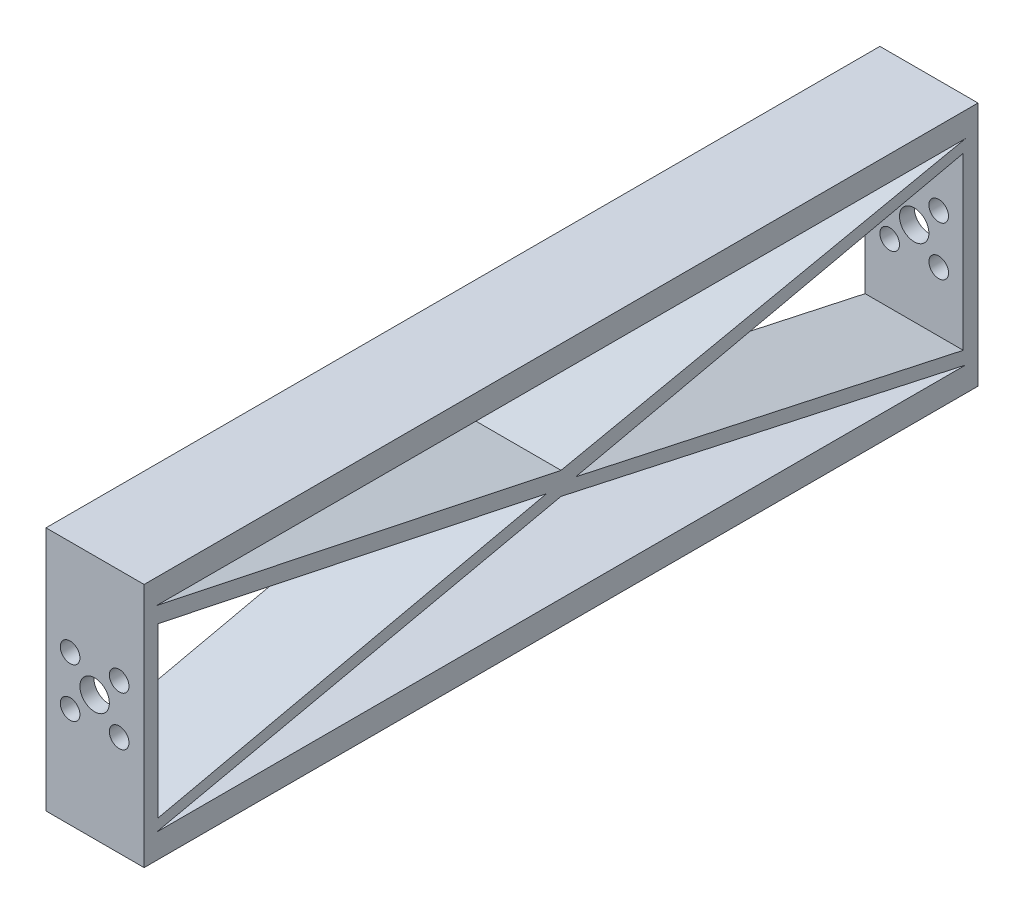
ISO-10303-21;
HEADER;
FILE_DESCRIPTION(('STEP AP214'),'2;1');
FILE_NAME('part.step','',(''),(''),'','','');
FILE_SCHEMA(('AUTOMOTIVE_DESIGN { 1 0 10303 214 1 1 1 1 }'));
ENDSEC;
DATA;
#1=APPLICATION_CONTEXT('core data for automotive mechanical design processes');
#2=APPLICATION_PROTOCOL_DEFINITION('international standard','automotive_design',2000,#1);
#3=PRODUCT_CONTEXT('',#1,'mechanical');
#4=PRODUCT('Part','Part','',(#3));
#5=PRODUCT_RELATED_PRODUCT_CATEGORY('part','',(#4));
#6=PRODUCT_DEFINITION_FORMATION('','',#4);
#7=PRODUCT_DEFINITION_CONTEXT('part definition',#1,'design');
#8=PRODUCT_DEFINITION('design','',#6,#7);
#9=PRODUCT_DEFINITION_SHAPE('','',#8);
#10=(LENGTH_UNIT() NAMED_UNIT(*) SI_UNIT(.MILLI.,.METRE.));
#11=(NAMED_UNIT(*) PLANE_ANGLE_UNIT() SI_UNIT($,.RADIAN.));
#12=(NAMED_UNIT(*) SI_UNIT($,.STERADIAN.) SOLID_ANGLE_UNIT());
#13=UNCERTAINTY_MEASURE_WITH_UNIT(LENGTH_MEASURE(1.E-05),#10,'distance_accuracy_value','');
#14=(GEOMETRIC_REPRESENTATION_CONTEXT(3) GLOBAL_UNCERTAINTY_ASSIGNED_CONTEXT((#13)) GLOBAL_UNIT_ASSIGNED_CONTEXT((#10,
#11,#12)) REPRESENTATION_CONTEXT('',''));
#15=CARTESIAN_POINT('',(0.,0.,0.));
#16=DIRECTION('',(0.,0.,1.));
#17=DIRECTION('',(1.,0.,0.));
#18=AXIS2_PLACEMENT_3D('',#15,#16,#17);
#19=CARTESIAN_POINT('',(20.,0.,0.));
#20=DIRECTION('',(1.,0.,0.));
#21=DIRECTION('',(0.,0.,-1.));
#22=AXIS2_PLACEMENT_3D('',#19,#20,#21);
#23=PLANE('',#22);
#24=DIRECTION('',(0.,-0.217683623773377,0.976019385023111));
#25=VECTOR('',#24,1.);
#26=CARTESIAN_POINT('',(20.,0.,2.99411560938043));
#27=LINE('',#26,#25);
#28=CARTESIAN_POINT('',(20.,0.,2.99411560938043));
#29=VERTEX_POINT('',#28);
#30=CARTESIAN_POINT('',(20.,-17.6539857058807,82.1485874671195));
#31=VERTEX_POINT('',#30);
#32=EDGE_CURVE('E153',#29,#31,#27,.T.);
#33=ORIENTED_EDGE('',*,*,#32,.T.);
#34=DIRECTION('',(0.,1.,0.));
#35=VECTOR('',#34,1.);
#36=CARTESIAN_POINT('',(20.,16.6477294414774,82.1485874671195));
#37=LINE('',#36,#35);
#38=CARTESIAN_POINT('',(20.,16.6477294414774,82.1485874671195));
#39=VERTEX_POINT('',#38);
#40=EDGE_CURVE('E160',#31,#39,#37,.T.);
#41=ORIENTED_EDGE('',*,*,#40,.T.);
#42=DIRECTION('',(0.,-0.205816684330834,-0.978590564256095));
#43=VECTOR('',#42,1.);
#44=CARTESIAN_POINT('',(20.,0.,2.99411560938043));
#45=LINE('',#44,#43);
#46=EDGE_CURVE('E53',#39,#29,#45,.T.);
#47=ORIENTED_EDGE('',*,*,#46,.T.);
#48=EDGE_LOOP('',(#33,#41,#47));
#49=FACE_BOUND('',#48,.T.);
#50=DIRECTION('',(0.,0.21225221971698,0.977214917623147));
#51=VECTOR('',#50,1.);
#52=CARTESIAN_POINT('',(20.,0.,-2.99411560938062));
#53=LINE('',#52,#51);
#54=CARTESIAN_POINT('',(20.,-17.1585856076037,-81.992704379959));
#55=VERTEX_POINT('',#54);
#56=CARTESIAN_POINT('',(20.,0.,-2.99411560938062));
#57=VERTEX_POINT('',#56);
#58=EDGE_CURVE('E182',#55,#57,#53,.T.);
#59=ORIENTED_EDGE('',*,*,#58,.T.);
#60=DIRECTION('',(0.,0.217683623773377,-0.976019385023111));
#61=VECTOR('',#60,1.);
#62=CARTESIAN_POINT('',(20.,0.,-2.99411560938062));
#63=LINE('',#62,#61);
#64=CARTESIAN_POINT('',(20.,17.6192187782778,-81.992704379959));
#65=VERTEX_POINT('',#64);
#66=EDGE_CURVE('E185',#57,#65,#63,.T.);
#67=ORIENTED_EDGE('',*,*,#66,.T.);
#68=DIRECTION('',(0.,-1.,0.));
#69=VECTOR('',#68,1.);
#70=CARTESIAN_POINT('',(20.,17.6192187782778,-81.992704379959));
#71=LINE('',#70,#69);
#72=EDGE_CURVE('E189',#65,#55,#71,.T.);
#73=ORIENTED_EDGE('',*,*,#72,.T.);
#74=EDGE_LOOP('',(#59,#67,#73));
#75=FACE_BOUND('',#74,.T.);
#76=DIRECTION('',(0.,0.205816684330834,0.978590564256095));
#77=VECTOR('',#76,1.);
#78=CARTESIAN_POINT('',(20.,2.53644296567931,-0.533463432265187));
#79=LINE('',#78,#77);
#80=CARTESIAN_POINT('',(20.,2.64864073137515,0.));
#81=VERTEX_POINT('',#80);
#82=CARTESIAN_POINT('',(20.,20.,82.5));
#83=VERTEX_POINT('',#82);
#84=EDGE_CURVE('E235',#81,#83,#79,.T.);
#85=ORIENTED_EDGE('',*,*,#84,.T.);
#86=DIRECTION('',(0.,0.,1.));
#87=VECTOR('',#86,1.);
#88=CARTESIAN_POINT('',(20.,20.,0.));
#89=LINE('',#88,#87);
#90=CARTESIAN_POINT('',(20.,20.,-82.5));
#91=VERTEX_POINT('',#90);
#92=EDGE_CURVE('E229',#91,#83,#89,.T.);
#93=ORIENTED_EDGE('',*,*,#92,.F.);
#94=DIRECTION('',(0.,-0.205816684330834,0.978590564256095));
#95=VECTOR('',#94,1.);
#96=CARTESIAN_POINT('',(20.,2.53644296567931,0.533463432265187));
#97=LINE('',#96,#95);
#98=EDGE_CURVE('E231',#91,#81,#97,.T.);
#99=ORIENTED_EDGE('',*,*,#98,.T.);
#100=EDGE_LOOP('',(#85,#93,#99));
#101=FACE_BOUND('',#100,.T.);
#102=DIRECTION('',(0.,1.,0.));
#103=VECTOR('',#102,1.);
#104=CARTESIAN_POINT('',(20.,25.,-85.0000000000001));
#105=LINE('',#104,#103);
#106=CARTESIAN_POINT('',(20.,-25.,-85.0000000000001));
#107=VERTEX_POINT('',#106);
#108=CARTESIAN_POINT('',(20.,25.,-85.0000000000001));
#109=VERTEX_POINT('',#108);
#110=EDGE_CURVE('E253',#107,#109,#105,.T.);
#111=ORIENTED_EDGE('',*,*,#110,.T.);
#112=DIRECTION('',(0.,0.,1.));
#113=VECTOR('',#112,1.);
#114=CARTESIAN_POINT('',(20.,25.,84.9999999999999));
#115=LINE('',#114,#113);
#116=CARTESIAN_POINT('',(20.,25.,84.9999999999999));
#117=VERTEX_POINT('',#116);
#118=EDGE_CURVE('E256',#109,#117,#115,.T.);
#119=ORIENTED_EDGE('',*,*,#118,.T.);
#120=DIRECTION('',(0.,-1.,0.));
#121=VECTOR('',#120,1.);
#122=CARTESIAN_POINT('',(20.,25.,84.9999999999999));
#123=LINE('',#122,#121);
#124=CARTESIAN_POINT('',(20.,-25.,84.9999999999999));
#125=VERTEX_POINT('',#124);
#126=EDGE_CURVE('E259',#117,#125,#123,.T.);
#127=ORIENTED_EDGE('',*,*,#126,.T.);
#128=DIRECTION('',(0.,0.,-1.));
#129=VECTOR('',#128,1.);
#130=CARTESIAN_POINT('',(20.,-25.,84.9999999999999));
#131=LINE('',#130,#129);
#132=EDGE_CURVE('E261',#125,#107,#131,.T.);
#133=ORIENTED_EDGE('',*,*,#132,.T.);
#134=EDGE_LOOP('',(#111,#119,#127,#133));
#135=FACE_BOUND('',#134,.T.);
#136=DIRECTION('',(0.,0.,1.));
#137=VECTOR('',#136,1.);
#138=CARTESIAN_POINT('',(20.,-20.,0.));
#139=LINE('',#138,#137);
#140=CARTESIAN_POINT('',(20.,-20.,-82.5));
#141=VERTEX_POINT('',#140);
#142=CARTESIAN_POINT('',(20.,-20.,82.5));
#143=VERTEX_POINT('',#142);
#144=EDGE_CURVE('E211',#141,#143,#139,.T.);
#145=ORIENTED_EDGE('',*,*,#144,.T.);
#146=DIRECTION('',(0.,-0.213645280255902,0.976911303151099));
#147=VECTOR('',#146,1.);
#148=CARTESIAN_POINT('',(20.,-1.86833352987041,-0.408594556448615));
#149=LINE('',#148,#147);
#150=CARTESIAN_POINT('',(20.,-1.9576909753641,0.));
#151=VERTEX_POINT('',#150);
#152=EDGE_CURVE('E206',#151,#143,#149,.T.);
#153=ORIENTED_EDGE('',*,*,#152,.F.);
#154=DIRECTION('',(0.,0.213645280255902,0.976911303151099));
#155=VECTOR('',#154,1.);
#156=CARTESIAN_POINT('',(20.,-1.86833352987041,0.408594556448614));
#157=LINE('',#156,#155);
#158=EDGE_CURVE('E208',#141,#151,#157,.T.);
#159=ORIENTED_EDGE('',*,*,#158,.F.);
#160=EDGE_LOOP('',(#145,#153,#159));
#161=FACE_BOUND('',#160,.T.);
#162=ADVANCED_FACE('F36',(#49,#75,#101,#135,#161),#23,.T.);
#163=CARTESIAN_POINT('',(0.,0.,0.));
#164=DIRECTION('',(1.,0.,0.));
#165=DIRECTION('',(0.,0.,-1.));
#166=AXIS2_PLACEMENT_3D('',#163,#164,#165);
#167=PLANE('',#166);
#168=DIRECTION('',(0.,1.,0.));
#169=VECTOR('',#168,1.);
#170=CARTESIAN_POINT('',(0.,16.6477294414774,82.1485874671195));
#171=LINE('',#170,#169);
#172=CARTESIAN_POINT('',(0.,-17.6539857058807,82.1485874671195));
#173=VERTEX_POINT('',#172);
#174=CARTESIAN_POINT('',(0.,16.6477294414774,82.1485874671195));
#175=VERTEX_POINT('',#174);
#176=EDGE_CURVE('E168',#173,#175,#171,.T.);
#177=ORIENTED_EDGE('',*,*,#176,.F.);
#178=DIRECTION('',(0.,-0.217683623773377,0.976019385023111));
#179=VECTOR('',#178,1.);
#180=CARTESIAN_POINT('',(0.,0.,2.99411560938043));
#181=LINE('',#180,#179);
#182=CARTESIAN_POINT('',(0.,0.,2.99411560938043));
#183=VERTEX_POINT('',#182);
#184=EDGE_CURVE('E61',#183,#173,#181,.T.);
#185=ORIENTED_EDGE('',*,*,#184,.F.);
#186=DIRECTION('',(0.,-0.205816684330834,-0.978590564256095));
#187=VECTOR('',#186,1.);
#188=CARTESIAN_POINT('',(0.,0.,2.99411560938043));
#189=LINE('',#188,#187);
#190=EDGE_CURVE('E165',#175,#183,#189,.T.);
#191=ORIENTED_EDGE('',*,*,#190,.F.);
#192=EDGE_LOOP('',(#177,#185,#191));
#193=FACE_BOUND('',#192,.T.);
#194=DIRECTION('',(0.,0.217683623773377,-0.976019385023111));
#195=VECTOR('',#194,1.);
#196=CARTESIAN_POINT('',(0.,0.,-2.99411560938062));
#197=LINE('',#196,#195);
#198=CARTESIAN_POINT('',(0.,0.,-2.99411560938062));
#199=VERTEX_POINT('',#198);
#200=CARTESIAN_POINT('',(0.,17.6192187782778,-81.992704379959));
#201=VERTEX_POINT('',#200);
#202=EDGE_CURVE('E194',#199,#201,#197,.T.);
#203=ORIENTED_EDGE('',*,*,#202,.F.);
#204=DIRECTION('',(0.,0.21225221971698,0.977214917623147));
#205=VECTOR('',#204,1.);
#206=CARTESIAN_POINT('',(0.,0.,-2.99411560938062));
#207=LINE('',#206,#205);
#208=CARTESIAN_POINT('',(0.,-17.1585856076037,-81.992704379959));
#209=VERTEX_POINT('',#208);
#210=EDGE_CURVE('E180',#209,#199,#207,.T.);
#211=ORIENTED_EDGE('',*,*,#210,.F.);
#212=DIRECTION('',(0.,-1.,0.));
#213=VECTOR('',#212,1.);
#214=CARTESIAN_POINT('',(0.,17.6192187782778,-81.992704379959));
#215=LINE('',#214,#213);
#216=EDGE_CURVE('E186',#201,#209,#215,.T.);
#217=ORIENTED_EDGE('',*,*,#216,.F.);
#218=EDGE_LOOP('',(#203,#211,#217));
#219=FACE_BOUND('',#218,.T.);
#220=DIRECTION('',(0.,0.,1.));
#221=VECTOR('',#220,1.);
#222=CARTESIAN_POINT('',(0.,20.,0.));
#223=LINE('',#222,#221);
#224=CARTESIAN_POINT('',(0.,20.,-82.5));
#225=VERTEX_POINT('',#224);
#226=CARTESIAN_POINT('',(0.,20.,82.5));
#227=VERTEX_POINT('',#226);
#228=EDGE_CURVE('E224',#225,#227,#223,.T.);
#229=ORIENTED_EDGE('',*,*,#228,.T.);
#230=DIRECTION('',(0.,0.205816684330834,0.978590564256095));
#231=VECTOR('',#230,1.);
#232=CARTESIAN_POINT('',(0.,2.53644296567931,-0.533463432265187));
#233=LINE('',#232,#231);
#234=CARTESIAN_POINT('',(0.,2.64864073137515,0.));
#235=VERTEX_POINT('',#234);
#236=EDGE_CURVE('E232',#235,#227,#233,.T.);
#237=ORIENTED_EDGE('',*,*,#236,.F.);
#238=DIRECTION('',(0.,-0.205816684330834,0.978590564256095));
#239=VECTOR('',#238,1.);
#240=CARTESIAN_POINT('',(0.,2.53644296567931,0.533463432265187));
#241=LINE('',#240,#239);
#242=EDGE_CURVE('E241',#225,#235,#241,.T.);
#243=ORIENTED_EDGE('',*,*,#242,.F.);
#244=EDGE_LOOP('',(#229,#237,#243));
#245=FACE_BOUND('',#244,.T.);
#246=DIRECTION('',(0.,1.,0.));
#247=VECTOR('',#246,1.);
#248=CARTESIAN_POINT('',(0.,25.,-85.0000000000001));
#249=LINE('',#248,#247);
#250=CARTESIAN_POINT('',(0.,-25.,-85.0000000000001));
#251=VERTEX_POINT('',#250);
#252=CARTESIAN_POINT('',(0.,25.,-85.0000000000001));
#253=VERTEX_POINT('',#252);
#254=EDGE_CURVE('E248',#251,#253,#249,.T.);
#255=ORIENTED_EDGE('',*,*,#254,.F.);
#256=DIRECTION('',(0.,0.,-1.));
#257=VECTOR('',#256,1.);
#258=CARTESIAN_POINT('',(0.,-25.,84.9999999999999));
#259=LINE('',#258,#257);
#260=CARTESIAN_POINT('',(0.,-25.,84.9999999999999));
#261=VERTEX_POINT('',#260);
#262=EDGE_CURVE('E257',#261,#251,#259,.T.);
#263=ORIENTED_EDGE('',*,*,#262,.F.);
#264=DIRECTION('',(0.,-1.,0.));
#265=VECTOR('',#264,1.);
#266=CARTESIAN_POINT('',(0.,25.,84.9999999999999));
#267=LINE('',#266,#265);
#268=CARTESIAN_POINT('',(0.,25.,84.9999999999999));
#269=VERTEX_POINT('',#268);
#270=EDGE_CURVE('E268',#269,#261,#267,.T.);
#271=ORIENTED_EDGE('',*,*,#270,.F.);
#272=DIRECTION('',(0.,0.,1.));
#273=VECTOR('',#272,1.);
#274=CARTESIAN_POINT('',(0.,25.,84.9999999999999));
#275=LINE('',#274,#273);
#276=EDGE_CURVE('E266',#253,#269,#275,.T.);
#277=ORIENTED_EDGE('',*,*,#276,.F.);
#278=EDGE_LOOP('',(#255,#263,#271,#277));
#279=FACE_BOUND('',#278,.T.);
#280=DIRECTION('',(0.,-0.213645280255902,0.976911303151099));
#281=VECTOR('',#280,1.);
#282=CARTESIAN_POINT('',(0.,-1.86833352987041,-0.408594556448615));
#283=LINE('',#282,#281);
#284=CARTESIAN_POINT('',(0.,-1.9576909753641,0.));
#285=VERTEX_POINT('',#284);
#286=CARTESIAN_POINT('',(0.,-20.,82.5));
#287=VERTEX_POINT('',#286);
#288=EDGE_CURVE('E201',#285,#287,#283,.T.);
#289=ORIENTED_EDGE('',*,*,#288,.T.);
#290=DIRECTION('',(0.,0.,1.));
#291=VECTOR('',#290,1.);
#292=CARTESIAN_POINT('',(0.,-20.,0.));
#293=LINE('',#292,#291);
#294=CARTESIAN_POINT('',(0.,-20.,-82.5));
#295=VERTEX_POINT('',#294);
#296=EDGE_CURVE('E209',#295,#287,#293,.T.);
#297=ORIENTED_EDGE('',*,*,#296,.F.);
#298=DIRECTION('',(0.,0.213645280255902,0.976911303151099));
#299=VECTOR('',#298,1.);
#300=CARTESIAN_POINT('',(0.,-1.86833352987041,0.408594556448614));
#301=LINE('',#300,#299);
#302=EDGE_CURVE('E217',#295,#285,#301,.T.);
#303=ORIENTED_EDGE('',*,*,#302,.T.);
#304=EDGE_LOOP('',(#289,#297,#303));
#305=FACE_BOUND('',#304,.T.);
#306=ADVANCED_FACE('F357',(#193,#219,#245,#279,#305),#167,.F.);
#307=CARTESIAN_POINT('',(20.,25.,-85.0000000000001));
#308=DIRECTION('',(0.,0.,1.));
#309=DIRECTION('',(1.,0.,0.));
#310=AXIS2_PLACEMENT_3D('',#307,#308,#309);
#311=PLANE('',#310);
#312=CARTESIAN_POINT('',(15.,-5.,-85.0000000000001));
#313=DIRECTION('',(0.,0.,-1.));
#314=DIRECTION('',(-1.,0.,0.));
#315=AXIS2_PLACEMENT_3D('',#312,#313,#314);
#316=CIRCLE('',#315,2.);
#317=CARTESIAN_POINT('',(13.,-5.,-85.0000000000001));
#318=VERTEX_POINT('',#317);
#319=EDGE_CURVE('E319',#318,#318,#316,.T.);
#320=ORIENTED_EDGE('',*,*,#319,.F.);
#321=EDGE_LOOP('',(#320));
#322=FACE_BOUND('',#321,.T.);
#323=CARTESIAN_POINT('',(5.,-5.,-85.0000000000001));
#324=DIRECTION('',(0.,0.,-1.));
#325=DIRECTION('',(-1.,0.,0.));
#326=AXIS2_PLACEMENT_3D('',#323,#324,#325);
#327=CIRCLE('',#326,2.);
#328=CARTESIAN_POINT('',(3.,-5.,-85.0000000000001));
#329=VERTEX_POINT('',#328);
#330=EDGE_CURVE('E309',#329,#329,#327,.T.);
#331=ORIENTED_EDGE('',*,*,#330,.F.);
#332=EDGE_LOOP('',(#331));
#333=FACE_BOUND('',#332,.T.);
#334=CARTESIAN_POINT('',(10.,0.,-85.0000000000001));
#335=DIRECTION('',(0.,0.,-1.));
#336=DIRECTION('',(-1.,0.,0.));
#337=AXIS2_PLACEMENT_3D('',#334,#335,#336);
#338=CIRCLE('',#337,3.);
#339=CARTESIAN_POINT('',(7.,0.,-85.0000000000001));
#340=VERTEX_POINT('',#339);
#341=EDGE_CURVE('E306',#340,#340,#338,.T.);
#342=ORIENTED_EDGE('',*,*,#341,.F.);
#343=EDGE_LOOP('',(#342));
#344=FACE_BOUND('',#343,.T.);
#345=CARTESIAN_POINT('',(5.,5.,-85.0000000000001));
#346=DIRECTION('',(0.,0.,-1.));
#347=DIRECTION('',(-1.,0.,0.));
#348=AXIS2_PLACEMENT_3D('',#345,#346,#347);
#349=CIRCLE('',#348,2.);
#350=CARTESIAN_POINT('',(3.,5.,-85.0000000000001));
#351=VERTEX_POINT('',#350);
#352=EDGE_CURVE('E303',#351,#351,#349,.T.);
#353=ORIENTED_EDGE('',*,*,#352,.F.);
#354=EDGE_LOOP('',(#353));
#355=FACE_BOUND('',#354,.T.);
#356=CARTESIAN_POINT('',(15.,5.,-85.0000000000001));
#357=DIRECTION('',(0.,0.,-1.));
#358=DIRECTION('',(-1.,0.,0.));
#359=AXIS2_PLACEMENT_3D('',#356,#357,#358);
#360=CIRCLE('',#359,2.);
#361=CARTESIAN_POINT('',(13.,5.,-85.0000000000001));
#362=VERTEX_POINT('',#361);
#363=EDGE_CURVE('E299',#362,#362,#360,.T.);
#364=ORIENTED_EDGE('',*,*,#363,.F.);
#365=EDGE_LOOP('',(#364));
#366=FACE_BOUND('',#365,.T.);
#367=ORIENTED_EDGE('',*,*,#254,.T.);
#368=DIRECTION('',(-1.,0.,0.));
#369=VECTOR('',#368,1.);
#370=CARTESIAN_POINT('',(20.,25.,-85.0000000000001));
#371=LINE('',#370,#369);
#372=EDGE_CURVE('E11',#109,#253,#371,.T.);
#373=ORIENTED_EDGE('',*,*,#372,.F.);
#374=ORIENTED_EDGE('',*,*,#110,.F.);
#375=DIRECTION('',(-1.,0.,0.));
#376=VECTOR('',#375,1.);
#377=CARTESIAN_POINT('',(20.,-25.,-85.0000000000001));
#378=LINE('',#377,#376);
#379=EDGE_CURVE('E263',#107,#251,#378,.T.);
#380=ORIENTED_EDGE('',*,*,#379,.T.);
#381=EDGE_LOOP('',(#367,#373,#374,#380));
#382=FACE_BOUND('',#381,.T.);
#383=ADVANCED_FACE('F38',(#322,#333,#344,#355,#366,#382),#311,.F.);
#384=CARTESIAN_POINT('',(20.,25.,84.9999999999999));
#385=DIRECTION('',(0.,-1.,0.));
#386=DIRECTION('',(0.,0.,-1.));
#387=AXIS2_PLACEMENT_3D('',#384,#385,#386);
#388=PLANE('',#387);
#389=ORIENTED_EDGE('',*,*,#276,.T.);
#390=DIRECTION('',(-1.,0.,0.));
#391=VECTOR('',#390,1.);
#392=CARTESIAN_POINT('',(20.,25.,84.9999999999999));
#393=LINE('',#392,#391);
#394=EDGE_CURVE('E45',#117,#269,#393,.T.);
#395=ORIENTED_EDGE('',*,*,#394,.F.);
#396=ORIENTED_EDGE('',*,*,#118,.F.);
#397=ORIENTED_EDGE('',*,*,#372,.T.);
#398=EDGE_LOOP('',(#389,#395,#396,#397));
#399=FACE_BOUND('',#398,.T.);
#400=ADVANCED_FACE('F341',(#399),#388,.F.);
#401=CARTESIAN_POINT('',(20.,25.,84.9999999999999));
#402=DIRECTION('',(0.,0.,-1.));
#403=DIRECTION('',(-1.,0.,0.));
#404=AXIS2_PLACEMENT_3D('',#401,#402,#403);
#405=PLANE('',#404);
#406=CARTESIAN_POINT('',(4.91550237214592,5.47898451277321,84.9999999999999));
#407=DIRECTION('',(0.,0.,1.));
#408=DIRECTION('',(1.,0.,0.));
#409=AXIS2_PLACEMENT_3D('',#406,#407,#408);
#410=CIRCLE('',#409,2.);
#411=CARTESIAN_POINT('',(6.91550237214592,5.47898451277321,84.9999999999999));
#412=VERTEX_POINT('',#411);
#413=EDGE_CURVE('E295',#412,#412,#410,.T.);
#414=ORIENTED_EDGE('',*,*,#413,.F.);
#415=EDGE_LOOP('',(#414));
#416=FACE_BOUND('',#415,.T.);
#417=CARTESIAN_POINT('',(14.9155023721459,5.47898451277321,84.9999999999999));
#418=DIRECTION('',(0.,0.,1.));
#419=DIRECTION('',(1.,0.,0.));
#420=AXIS2_PLACEMENT_3D('',#417,#418,#419);
#421=CIRCLE('',#420,2.);
#422=CARTESIAN_POINT('',(16.9155023721459,5.47898451277321,84.9999999999999));
#423=VERTEX_POINT('',#422);
#424=EDGE_CURVE('E291',#423,#423,#421,.T.);
#425=ORIENTED_EDGE('',*,*,#424,.F.);
#426=EDGE_LOOP('',(#425));
#427=FACE_BOUND('',#426,.T.);
#428=CARTESIAN_POINT('',(9.91550237214592,0.478984512773212,84.9999999999999));
#429=DIRECTION('',(0.,0.,1.));
#430=DIRECTION('',(1.,0.,0.));
#431=AXIS2_PLACEMENT_3D('',#428,#429,#430);
#432=CIRCLE('',#431,3.);
#433=CARTESIAN_POINT('',(12.9155023721459,0.478984512773212,84.9999999999999));
#434=VERTEX_POINT('',#433);
#435=EDGE_CURVE('E287',#434,#434,#432,.T.);
#436=ORIENTED_EDGE('',*,*,#435,.F.);
#437=EDGE_LOOP('',(#436));
#438=FACE_BOUND('',#437,.T.);
#439=CARTESIAN_POINT('',(14.9155023721459,-4.52101548722679,84.9999999999999));
#440=DIRECTION('',(0.,0.,1.));
#441=DIRECTION('',(1.,0.,0.));
#442=AXIS2_PLACEMENT_3D('',#439,#440,#441);
#443=CIRCLE('',#442,2.);
#444=CARTESIAN_POINT('',(16.9155023721459,-4.52101548722679,84.9999999999999));
#445=VERTEX_POINT('',#444);
#446=EDGE_CURVE('E283',#445,#445,#443,.T.);
#447=ORIENTED_EDGE('',*,*,#446,.F.);
#448=EDGE_LOOP('',(#447));
#449=FACE_BOUND('',#448,.T.);
#450=CARTESIAN_POINT('',(4.91550237214592,-4.52101548722679,84.9999999999999));
#451=DIRECTION('',(0.,0.,1.));
#452=DIRECTION('',(1.,0.,0.));
#453=AXIS2_PLACEMENT_3D('',#450,#451,#452);
#454=CIRCLE('',#453,2.);
#455=CARTESIAN_POINT('',(6.91550237214592,-4.52101548722679,84.9999999999999));
#456=VERTEX_POINT('',#455);
#457=EDGE_CURVE('E171',#456,#456,#454,.T.);
#458=ORIENTED_EDGE('',*,*,#457,.F.);
#459=EDGE_LOOP('',(#458));
#460=FACE_BOUND('',#459,.T.);
#461=ORIENTED_EDGE('',*,*,#270,.T.);
#462=DIRECTION('',(-1.,0.,0.));
#463=VECTOR('',#462,1.);
#464=CARTESIAN_POINT('',(20.,-25.,84.9999999999999));
#465=LINE('',#464,#463);
#466=EDGE_CURVE('E273',#125,#261,#465,.T.);
#467=ORIENTED_EDGE('',*,*,#466,.F.);
#468=ORIENTED_EDGE('',*,*,#126,.F.);
#469=ORIENTED_EDGE('',*,*,#394,.T.);
#470=EDGE_LOOP('',(#461,#467,#468,#469));
#471=FACE_BOUND('',#470,.T.);
#472=ADVANCED_FACE('F337',(#416,#427,#438,#449,#460,#471),#405,.F.);
#473=CARTESIAN_POINT('',(20.,-25.,84.9999999999999));
#474=DIRECTION('',(0.,1.,0.));
#475=DIRECTION('',(0.,0.,1.));
#476=AXIS2_PLACEMENT_3D('',#473,#474,#475);
#477=PLANE('',#476);
#478=ORIENTED_EDGE('',*,*,#262,.T.);
#479=ORIENTED_EDGE('',*,*,#379,.F.);
#480=ORIENTED_EDGE('',*,*,#132,.F.);
#481=ORIENTED_EDGE('',*,*,#466,.T.);
#482=EDGE_LOOP('',(#478,#479,#480,#481));
#483=FACE_BOUND('',#482,.T.);
#484=ADVANCED_FACE('F340',(#483),#477,.F.);
#485=CARTESIAN_POINT('',(20.,20.,0.));
#486=DIRECTION('',(0.,-1.,0.));
#487=DIRECTION('',(0.,0.,-1.));
#488=AXIS2_PLACEMENT_3D('',#485,#486,#487);
#489=PLANE('',#488);
#490=ORIENTED_EDGE('',*,*,#228,.F.);
#491=DIRECTION('',(-1.,0.,0.));
#492=VECTOR('',#491,1.);
#493=CARTESIAN_POINT('',(20.,20.,-82.5));
#494=LINE('',#493,#492);
#495=EDGE_CURVE('E238',#91,#225,#494,.T.);
#496=ORIENTED_EDGE('',*,*,#495,.F.);
#497=ORIENTED_EDGE('',*,*,#92,.T.);
#498=DIRECTION('',(-1.,0.,0.));
#499=VECTOR('',#498,1.);
#500=CARTESIAN_POINT('',(20.,20.,82.5));
#501=LINE('',#500,#499);
#502=EDGE_CURVE('E246',#83,#227,#501,.T.);
#503=ORIENTED_EDGE('',*,*,#502,.T.);
#504=EDGE_LOOP('',(#490,#496,#497,#503));
#505=FACE_BOUND('',#504,.T.);
#506=ADVANCED_FACE('F378',(#505),#489,.T.);
#507=CARTESIAN_POINT('',(20.,2.53644296567931,-0.533463432265187));
#508=DIRECTION('',(0.,-0.978590564256095,0.205816684330834));
#509=DIRECTION('',(0.,-0.205816684330834,-0.978590564256095));
#510=AXIS2_PLACEMENT_3D('',#507,#508,#509);
#511=PLANE('',#510);
#512=ORIENTED_EDGE('',*,*,#236,.T.);
#513=ORIENTED_EDGE('',*,*,#502,.F.);
#514=ORIENTED_EDGE('',*,*,#84,.F.);
#515=DIRECTION('',(-1.,0.,0.));
#516=VECTOR('',#515,1.);
#517=CARTESIAN_POINT('',(20.,2.64864073137515,0.));
#518=LINE('',#517,#516);
#519=EDGE_CURVE('E249',#81,#235,#518,.T.);
#520=ORIENTED_EDGE('',*,*,#519,.T.);
#521=EDGE_LOOP('',(#512,#513,#514,#520));
#522=FACE_BOUND('',#521,.T.);
#523=ADVANCED_FACE('F385',(#522),#511,.F.);
#524=CARTESIAN_POINT('',(20.,2.53644296567931,0.533463432265187));
#525=DIRECTION('',(0.,-0.978590564256095,-0.205816684330834));
#526=DIRECTION('',(0.,0.205816684330834,-0.978590564256095));
#527=AXIS2_PLACEMENT_3D('',#524,#525,#526);
#528=PLANE('',#527);
#529=ORIENTED_EDGE('',*,*,#242,.T.);
#530=ORIENTED_EDGE('',*,*,#519,.F.);
#531=ORIENTED_EDGE('',*,*,#98,.F.);
#532=ORIENTED_EDGE('',*,*,#495,.T.);
#533=EDGE_LOOP('',(#529,#530,#531,#532));
#534=FACE_BOUND('',#533,.T.);
#535=ADVANCED_FACE('F390',(#534),#528,.F.);
#536=CARTESIAN_POINT('',(20.,-1.86833352987041,-0.408594556448615));
#537=DIRECTION('',(0.,-0.976911303151098,-0.213645280255902));
#538=DIRECTION('',(0.,0.213645280255902,-0.976911303151098));
#539=AXIS2_PLACEMENT_3D('',#536,#537,#538);
#540=PLANE('',#539);
#541=ORIENTED_EDGE('',*,*,#288,.F.);
#542=DIRECTION('',(-1.,0.,0.));
#543=VECTOR('',#542,1.);
#544=CARTESIAN_POINT('',(20.,-1.9576909753641,0.));
#545=LINE('',#544,#543);
#546=EDGE_CURVE('E214',#151,#285,#545,.T.);
#547=ORIENTED_EDGE('',*,*,#546,.F.);
#548=ORIENTED_EDGE('',*,*,#152,.T.);
#549=DIRECTION('',(-1.,0.,0.));
#550=VECTOR('',#549,1.);
#551=CARTESIAN_POINT('',(20.,-20.,82.5));
#552=LINE('',#551,#550);
#553=EDGE_CURVE('E222',#143,#287,#552,.T.);
#554=ORIENTED_EDGE('',*,*,#553,.T.);
#555=EDGE_LOOP('',(#541,#547,#548,#554));
#556=FACE_BOUND('',#555,.T.);
#557=ADVANCED_FACE('F403',(#556),#540,.T.);
#558=CARTESIAN_POINT('',(20.,-20.,0.));
#559=DIRECTION('',(0.,-1.,0.));
#560=DIRECTION('',(0.,0.,-1.));
#561=AXIS2_PLACEMENT_3D('',#558,#559,#560);
#562=PLANE('',#561);
#563=ORIENTED_EDGE('',*,*,#296,.T.);
#564=ORIENTED_EDGE('',*,*,#553,.F.);
#565=ORIENTED_EDGE('',*,*,#144,.F.);
#566=DIRECTION('',(-1.,0.,0.));
#567=VECTOR('',#566,1.);
#568=CARTESIAN_POINT('',(20.,-20.,-82.5));
#569=LINE('',#568,#567);
#570=EDGE_CURVE('E225',#141,#295,#569,.T.);
#571=ORIENTED_EDGE('',*,*,#570,.T.);
#572=EDGE_LOOP('',(#563,#564,#565,#571));
#573=FACE_BOUND('',#572,.T.);
#574=ADVANCED_FACE('F407',(#573),#562,.F.);
#575=CARTESIAN_POINT('',(20.,-1.86833352987041,0.408594556448614));
#576=DIRECTION('',(0.,-0.976911303151098,0.213645280255902));
#577=DIRECTION('',(0.,-0.213645280255902,-0.976911303151098));
#578=AXIS2_PLACEMENT_3D('',#575,#576,#577);
#579=PLANE('',#578);
#580=ORIENTED_EDGE('',*,*,#302,.F.);
#581=ORIENTED_EDGE('',*,*,#570,.F.);
#582=ORIENTED_EDGE('',*,*,#158,.T.);
#583=ORIENTED_EDGE('',*,*,#546,.T.);
#584=EDGE_LOOP('',(#580,#581,#582,#583));
#585=FACE_BOUND('',#584,.T.);
#586=ADVANCED_FACE('F411',(#585),#579,.T.);
#587=CARTESIAN_POINT('',(20.,0.,-2.99411560938062));
#588=DIRECTION('',(0.,-0.977214917623147,0.21225221971698));
#589=DIRECTION('',(0.,-0.21225221971698,-0.977214917623147));
#590=AXIS2_PLACEMENT_3D('',#587,#588,#589);
#591=PLANE('',#590);
#592=ORIENTED_EDGE('',*,*,#210,.T.);
#593=DIRECTION('',(-1.,0.,0.));
#594=VECTOR('',#593,1.);
#595=CARTESIAN_POINT('',(20.,0.,-2.99411560938062));
#596=LINE('',#595,#594);
#597=EDGE_CURVE('E192',#57,#199,#596,.T.);
#598=ORIENTED_EDGE('',*,*,#597,.F.);
#599=ORIENTED_EDGE('',*,*,#58,.F.);
#600=DIRECTION('',(-1.,0.,0.));
#601=VECTOR('',#600,1.);
#602=CARTESIAN_POINT('',(20.,-17.1585856076037,-81.992704379959));
#603=LINE('',#602,#601);
#604=EDGE_CURVE('E199',#55,#209,#603,.T.);
#605=ORIENTED_EDGE('',*,*,#604,.T.);
#606=EDGE_LOOP('',(#592,#598,#599,#605));
#607=FACE_BOUND('',#606,.T.);
#608=ADVANCED_FACE('F414',(#607),#591,.F.);
#609=CARTESIAN_POINT('',(20.,17.6192187782778,-81.992704379959));
#610=DIRECTION('',(0.,0.,-1.));
#611=DIRECTION('',(-1.,0.,0.));
#612=AXIS2_PLACEMENT_3D('',#609,#610,#611);
#613=PLANE('',#612);
#614=CARTESIAN_POINT('',(15.,-5.,-81.992704379959));
#615=DIRECTION('',(0.,0.,-1.));
#616=DIRECTION('',(-1.,0.,0.));
#617=AXIS2_PLACEMENT_3D('',#614,#615,#616);
#618=CIRCLE('',#617,2.);
#619=CARTESIAN_POINT('',(13.,-5.,-81.992704379959));
#620=VERTEX_POINT('',#619);
#621=EDGE_CURVE('E40',#620,#620,#618,.T.);
#622=ORIENTED_EDGE('',*,*,#621,.T.);
#623=EDGE_LOOP('',(#622));
#624=FACE_BOUND('',#623,.T.);
#625=CARTESIAN_POINT('',(5.,-5.,-81.992704379959));
#626=DIRECTION('',(0.,0.,-1.));
#627=DIRECTION('',(-1.,0.,0.));
#628=AXIS2_PLACEMENT_3D('',#625,#626,#627);
#629=CIRCLE('',#628,2.);
#630=CARTESIAN_POINT('',(3.,-5.,-81.992704379959));
#631=VERTEX_POINT('',#630);
#632=EDGE_CURVE('E307',#631,#631,#629,.T.);
#633=ORIENTED_EDGE('',*,*,#632,.T.);
#634=EDGE_LOOP('',(#633));
#635=FACE_BOUND('',#634,.T.);
#636=CARTESIAN_POINT('',(10.,0.,-81.992704379959));
#637=DIRECTION('',(0.,0.,-1.));
#638=DIRECTION('',(-1.,0.,0.));
#639=AXIS2_PLACEMENT_3D('',#636,#637,#638);
#640=CIRCLE('',#639,3.);
#641=CARTESIAN_POINT('',(7.,0.,-81.992704379959));
#642=VERTEX_POINT('',#641);
#643=EDGE_CURVE('E304',#642,#642,#640,.T.);
#644=ORIENTED_EDGE('',*,*,#643,.T.);
#645=EDGE_LOOP('',(#644));
#646=FACE_BOUND('',#645,.T.);
#647=CARTESIAN_POINT('',(5.,5.,-81.992704379959));
#648=DIRECTION('',(0.,0.,-1.));
#649=DIRECTION('',(-1.,0.,0.));
#650=AXIS2_PLACEMENT_3D('',#647,#648,#649);
#651=CIRCLE('',#650,2.);
#652=CARTESIAN_POINT('',(3.,5.,-81.992704379959));
#653=VERTEX_POINT('',#652);
#654=EDGE_CURVE('E300',#653,#653,#651,.T.);
#655=ORIENTED_EDGE('',*,*,#654,.T.);
#656=EDGE_LOOP('',(#655));
#657=FACE_BOUND('',#656,.T.);
#658=CARTESIAN_POINT('',(15.,5.,-81.992704379959));
#659=DIRECTION('',(0.,0.,-1.));
#660=DIRECTION('',(-1.,0.,0.));
#661=AXIS2_PLACEMENT_3D('',#658,#659,#660);
#662=CIRCLE('',#661,2.);
#663=CARTESIAN_POINT('',(13.,5.,-81.992704379959));
#664=VERTEX_POINT('',#663);
#665=EDGE_CURVE('E296',#664,#664,#662,.T.);
#666=ORIENTED_EDGE('',*,*,#665,.T.);
#667=EDGE_LOOP('',(#666));
#668=FACE_BOUND('',#667,.T.);
#669=ORIENTED_EDGE('',*,*,#216,.T.);
#670=ORIENTED_EDGE('',*,*,#604,.F.);
#671=ORIENTED_EDGE('',*,*,#72,.F.);
#672=DIRECTION('',(-1.,0.,0.));
#673=VECTOR('',#672,1.);
#674=CARTESIAN_POINT('',(20.,17.6192187782778,-81.992704379959));
#675=LINE('',#674,#673);
#676=EDGE_CURVE('E202',#65,#201,#675,.T.);
#677=ORIENTED_EDGE('',*,*,#676,.T.);
#678=EDGE_LOOP('',(#669,#670,#671,#677));
#679=FACE_BOUND('',#678,.T.);
#680=ADVANCED_FACE('F421',(#624,#635,#646,#657,#668,#679),#613,.F.);
#681=CARTESIAN_POINT('',(20.,0.,-2.99411560938062));
#682=DIRECTION('',(0.,0.976019385023111,0.217683623773377));
#683=DIRECTION('',(0.,-0.217683623773377,0.976019385023111));
#684=AXIS2_PLACEMENT_3D('',#681,#682,#683);
#685=PLANE('',#684);
#686=ORIENTED_EDGE('',*,*,#202,.T.);
#687=ORIENTED_EDGE('',*,*,#676,.F.);
#688=ORIENTED_EDGE('',*,*,#66,.F.);
#689=ORIENTED_EDGE('',*,*,#597,.T.);
#690=EDGE_LOOP('',(#686,#687,#688,#689));
#691=FACE_BOUND('',#690,.T.);
#692=ADVANCED_FACE('F423',(#691),#685,.F.);
#693=CARTESIAN_POINT('',(20.,0.,2.99411560938043));
#694=DIRECTION('',(0.,-0.976019385023111,-0.217683623773377));
#695=DIRECTION('',(0.,0.217683623773377,-0.976019385023111));
#696=AXIS2_PLACEMENT_3D('',#693,#694,#695);
#697=PLANE('',#696);
#698=ORIENTED_EDGE('',*,*,#184,.T.);
#699=DIRECTION('',(-1.,0.,0.));
#700=VECTOR('',#699,1.);
#701=CARTESIAN_POINT('',(20.,-17.6539857058807,82.1485874671195));
#702=LINE('',#701,#700);
#703=EDGE_CURVE('E149',#31,#173,#702,.T.);
#704=ORIENTED_EDGE('',*,*,#703,.F.);
#705=ORIENTED_EDGE('',*,*,#32,.F.);
#706=DIRECTION('',(-1.,0.,0.));
#707=VECTOR('',#706,1.);
#708=CARTESIAN_POINT('',(20.,0.,2.99411560938043));
#709=LINE('',#708,#707);
#710=EDGE_CURVE('E178',#29,#183,#709,.T.);
#711=ORIENTED_EDGE('',*,*,#710,.T.);
#712=EDGE_LOOP('',(#698,#704,#705,#711));
#713=FACE_BOUND('',#712,.T.);
#714=ADVANCED_FACE('F151',(#713),#697,.F.);
#715=CARTESIAN_POINT('',(20.,0.,2.99411560938043));
#716=DIRECTION('',(0.,0.978590564256095,-0.205816684330834));
#717=DIRECTION('',(0.,0.205816684330834,0.978590564256095));
#718=AXIS2_PLACEMENT_3D('',#715,#716,#717);
#719=PLANE('',#718);
#720=ORIENTED_EDGE('',*,*,#190,.T.);
#721=ORIENTED_EDGE('',*,*,#710,.F.);
#722=ORIENTED_EDGE('',*,*,#46,.F.);
#723=DIRECTION('',(-1.,0.,0.));
#724=VECTOR('',#723,1.);
#725=CARTESIAN_POINT('',(20.,16.6477294414774,82.1485874671195));
#726=LINE('',#725,#724);
#727=EDGE_CURVE('E157',#39,#175,#726,.T.);
#728=ORIENTED_EDGE('',*,*,#727,.T.);
#729=EDGE_LOOP('',(#720,#721,#722,#728));
#730=FACE_BOUND('',#729,.T.);
#731=ADVANCED_FACE('F432',(#730),#719,.F.);
#732=CARTESIAN_POINT('',(20.,16.6477294414774,82.1485874671195));
#733=DIRECTION('',(0.,0.,1.));
#734=DIRECTION('',(1.,0.,0.));
#735=AXIS2_PLACEMENT_3D('',#732,#733,#734);
#736=PLANE('',#735);
#737=CARTESIAN_POINT('',(4.91550237214592,5.47898451277321,82.1485874671195));
#738=DIRECTION('',(0.,0.,1.));
#739=DIRECTION('',(1.,0.,0.));
#740=AXIS2_PLACEMENT_3D('',#737,#738,#739);
#741=CIRCLE('',#740,2.);
#742=CARTESIAN_POINT('',(6.91550237214592,5.47898451277321,82.1485874671195));
#743=VERTEX_POINT('',#742);
#744=EDGE_CURVE('E292',#743,#743,#741,.T.);
#745=ORIENTED_EDGE('',*,*,#744,.T.);
#746=EDGE_LOOP('',(#745));
#747=FACE_BOUND('',#746,.T.);
#748=CARTESIAN_POINT('',(14.9155023721459,5.47898451277321,82.1485874671195));
#749=DIRECTION('',(0.,0.,1.));
#750=DIRECTION('',(1.,0.,0.));
#751=AXIS2_PLACEMENT_3D('',#748,#749,#750);
#752=CIRCLE('',#751,2.);
#753=CARTESIAN_POINT('',(16.9155023721459,5.47898451277321,82.1485874671195));
#754=VERTEX_POINT('',#753);
#755=EDGE_CURVE('E288',#754,#754,#752,.T.);
#756=ORIENTED_EDGE('',*,*,#755,.T.);
#757=EDGE_LOOP('',(#756));
#758=FACE_BOUND('',#757,.T.);
#759=CARTESIAN_POINT('',(9.91550237214592,0.478984512773212,82.1485874671195));
#760=DIRECTION('',(0.,0.,1.));
#761=DIRECTION('',(1.,0.,0.));
#762=AXIS2_PLACEMENT_3D('',#759,#760,#761);
#763=CIRCLE('',#762,3.);
#764=CARTESIAN_POINT('',(12.9155023721459,0.478984512773212,82.1485874671195));
#765=VERTEX_POINT('',#764);
#766=EDGE_CURVE('E284',#765,#765,#763,.T.);
#767=ORIENTED_EDGE('',*,*,#766,.T.);
#768=EDGE_LOOP('',(#767));
#769=FACE_BOUND('',#768,.T.);
#770=CARTESIAN_POINT('',(14.9155023721459,-4.52101548722679,82.1485874671195));
#771=DIRECTION('',(0.,0.,1.));
#772=DIRECTION('',(1.,0.,0.));
#773=AXIS2_PLACEMENT_3D('',#770,#771,#772);
#774=CIRCLE('',#773,2.);
#775=CARTESIAN_POINT('',(16.9155023721459,-4.52101548722679,82.1485874671195));
#776=VERTEX_POINT('',#775);
#777=EDGE_CURVE('E280',#776,#776,#774,.T.);
#778=ORIENTED_EDGE('',*,*,#777,.T.);
#779=EDGE_LOOP('',(#778));
#780=FACE_BOUND('',#779,.T.);
#781=CARTESIAN_POINT('',(4.91550237214592,-4.52101548722679,82.1485874671195));
#782=DIRECTION('',(0.,0.,1.));
#783=DIRECTION('',(1.,0.,0.));
#784=AXIS2_PLACEMENT_3D('',#781,#782,#783);
#785=CIRCLE('',#784,2.);
#786=CARTESIAN_POINT('',(6.91550237214592,-4.52101548722679,82.1485874671195));
#787=VERTEX_POINT('',#786);
#788=EDGE_CURVE('E176',#787,#787,#785,.T.);
#789=ORIENTED_EDGE('',*,*,#788,.T.);
#790=EDGE_LOOP('',(#789));
#791=FACE_BOUND('',#790,.T.);
#792=ORIENTED_EDGE('',*,*,#176,.T.);
#793=ORIENTED_EDGE('',*,*,#727,.F.);
#794=ORIENTED_EDGE('',*,*,#40,.F.);
#795=ORIENTED_EDGE('',*,*,#703,.T.);
#796=EDGE_LOOP('',(#792,#793,#794,#795));
#797=FACE_BOUND('',#796,.T.);
#798=ADVANCED_FACE('F161',(#747,#758,#769,#780,#791,#797),#736,.F.);
#799=CARTESIAN_POINT('',(4.91550237214592,-4.52101548722679,79.9999999999999));
#800=DIRECTION('',(0.,0.,1.));
#801=DIRECTION('',(1.,0.,0.));
#802=AXIS2_PLACEMENT_3D('',#799,#800,#801);
#803=CYLINDRICAL_SURFACE('',#802,2.);
#804=ORIENTED_EDGE('',*,*,#457,.T.);
#805=EDGE_LOOP('',(#804));
#806=FACE_BOUND('',#805,.T.);
#807=ORIENTED_EDGE('',*,*,#788,.F.);
#808=EDGE_LOOP('',(#807));
#809=FACE_BOUND('',#808,.T.);
#810=ADVANCED_FACE('F435',(#806,#809),#803,.F.);
#811=CARTESIAN_POINT('',(14.9155023721459,-4.52101548722679,79.9999999999999));
#812=DIRECTION('',(0.,0.,1.));
#813=DIRECTION('',(1.,0.,0.));
#814=AXIS2_PLACEMENT_3D('',#811,#812,#813);
#815=CYLINDRICAL_SURFACE('',#814,2.);
#816=ORIENTED_EDGE('',*,*,#446,.T.);
#817=EDGE_LOOP('',(#816));
#818=FACE_BOUND('',#817,.T.);
#819=ORIENTED_EDGE('',*,*,#777,.F.);
#820=EDGE_LOOP('',(#819));
#821=FACE_BOUND('',#820,.T.);
#822=ADVANCED_FACE('F334',(#818,#821),#815,.F.);
#823=CARTESIAN_POINT('',(9.91550237214592,0.478984512773212,79.9999999999999));
#824=DIRECTION('',(0.,0.,1.));
#825=DIRECTION('',(1.,0.,0.));
#826=AXIS2_PLACEMENT_3D('',#823,#824,#825);
#827=CYLINDRICAL_SURFACE('',#826,3.);
#828=ORIENTED_EDGE('',*,*,#435,.T.);
#829=EDGE_LOOP('',(#828));
#830=FACE_BOUND('',#829,.T.);
#831=ORIENTED_EDGE('',*,*,#766,.F.);
#832=EDGE_LOOP('',(#831));
#833=FACE_BOUND('',#832,.T.);
#834=ADVANCED_FACE('F444',(#830,#833),#827,.F.);
#835=CARTESIAN_POINT('',(14.9155023721459,5.47898451277321,79.9999999999999));
#836=DIRECTION('',(0.,0.,1.));
#837=DIRECTION('',(1.,0.,0.));
#838=AXIS2_PLACEMENT_3D('',#835,#836,#837);
#839=CYLINDRICAL_SURFACE('',#838,2.);
#840=ORIENTED_EDGE('',*,*,#424,.T.);
#841=EDGE_LOOP('',(#840));
#842=FACE_BOUND('',#841,.T.);
#843=ORIENTED_EDGE('',*,*,#755,.F.);
#844=EDGE_LOOP('',(#843));
#845=FACE_BOUND('',#844,.T.);
#846=ADVANCED_FACE('F447',(#842,#845),#839,.F.);
#847=CARTESIAN_POINT('',(4.91550237214592,5.47898451277321,79.9999999999999));
#848=DIRECTION('',(0.,0.,1.));
#849=DIRECTION('',(1.,0.,0.));
#850=AXIS2_PLACEMENT_3D('',#847,#848,#849);
#851=CYLINDRICAL_SURFACE('',#850,2.);
#852=ORIENTED_EDGE('',*,*,#413,.T.);
#853=EDGE_LOOP('',(#852));
#854=FACE_BOUND('',#853,.T.);
#855=ORIENTED_EDGE('',*,*,#744,.F.);
#856=EDGE_LOOP('',(#855));
#857=FACE_BOUND('',#856,.T.);
#858=ADVANCED_FACE('F451',(#854,#857),#851,.F.);
#859=CARTESIAN_POINT('',(15.,5.,-80.0000000000001));
#860=DIRECTION('',(0.,0.,-1.));
#861=DIRECTION('',(-1.,0.,0.));
#862=AXIS2_PLACEMENT_3D('',#859,#860,#861);
#863=CYLINDRICAL_SURFACE('',#862,2.);
#864=ORIENTED_EDGE('',*,*,#363,.T.);
#865=EDGE_LOOP('',(#864));
#866=FACE_BOUND('',#865,.T.);
#867=ORIENTED_EDGE('',*,*,#665,.F.);
#868=EDGE_LOOP('',(#867));
#869=FACE_BOUND('',#868,.T.);
#870=ADVANCED_FACE('F455',(#866,#869),#863,.F.);
#871=CARTESIAN_POINT('',(5.,5.,-80.0000000000001));
#872=DIRECTION('',(0.,0.,-1.));
#873=DIRECTION('',(-1.,0.,0.));
#874=AXIS2_PLACEMENT_3D('',#871,#872,#873);
#875=CYLINDRICAL_SURFACE('',#874,2.);
#876=ORIENTED_EDGE('',*,*,#352,.T.);
#877=EDGE_LOOP('',(#876));
#878=FACE_BOUND('',#877,.T.);
#879=ORIENTED_EDGE('',*,*,#654,.F.);
#880=EDGE_LOOP('',(#879));
#881=FACE_BOUND('',#880,.T.);
#882=ADVANCED_FACE('F459',(#878,#881),#875,.F.);
#883=CARTESIAN_POINT('',(10.,0.,-80.0000000000001));
#884=DIRECTION('',(0.,0.,-1.));
#885=DIRECTION('',(-1.,0.,0.));
#886=AXIS2_PLACEMENT_3D('',#883,#884,#885);
#887=CYLINDRICAL_SURFACE('',#886,3.);
#888=ORIENTED_EDGE('',*,*,#341,.T.);
#889=EDGE_LOOP('',(#888));
#890=FACE_BOUND('',#889,.T.);
#891=ORIENTED_EDGE('',*,*,#643,.F.);
#892=EDGE_LOOP('',(#891));
#893=FACE_BOUND('',#892,.T.);
#894=ADVANCED_FACE('F463',(#890,#893),#887,.F.);
#895=CARTESIAN_POINT('',(5.,-5.,-80.0000000000001));
#896=DIRECTION('',(0.,0.,-1.));
#897=DIRECTION('',(-1.,0.,0.));
#898=AXIS2_PLACEMENT_3D('',#895,#896,#897);
#899=CYLINDRICAL_SURFACE('',#898,2.);
#900=ORIENTED_EDGE('',*,*,#330,.T.);
#901=EDGE_LOOP('',(#900));
#902=FACE_BOUND('',#901,.T.);
#903=ORIENTED_EDGE('',*,*,#632,.F.);
#904=EDGE_LOOP('',(#903));
#905=FACE_BOUND('',#904,.T.);
#906=ADVANCED_FACE('F467',(#902,#905),#899,.F.);
#907=CARTESIAN_POINT('',(15.,-5.,-80.0000000000001));
#908=DIRECTION('',(0.,0.,-1.));
#909=DIRECTION('',(-1.,0.,0.));
#910=AXIS2_PLACEMENT_3D('',#907,#908,#909);
#911=CYLINDRICAL_SURFACE('',#910,2.);
#912=ORIENTED_EDGE('',*,*,#319,.T.);
#913=EDGE_LOOP('',(#912));
#914=FACE_BOUND('',#913,.T.);
#915=ORIENTED_EDGE('',*,*,#621,.F.);
#916=EDGE_LOOP('',(#915));
#917=FACE_BOUND('',#916,.T.);
#918=ADVANCED_FACE('F471',(#914,#917),#911,.F.);
#919=CLOSED_SHELL('',(#162,#306,#383,#400,#472,#484,#506,#523,#535,#557,#574,#586,#608,#680,
#692,#714,#731,#798,#810,#822,#834,#846,#858,#870,#882,#894,#906,#918));
#920=MANIFOLD_SOLID_BREP('B2',#919);
#921=ADVANCED_BREP_SHAPE_REPRESENTATION('',(#18,#920),#14);
#922=SHAPE_DEFINITION_REPRESENTATION(#9,#921);
ENDSEC;
END-ISO-10303-21;
